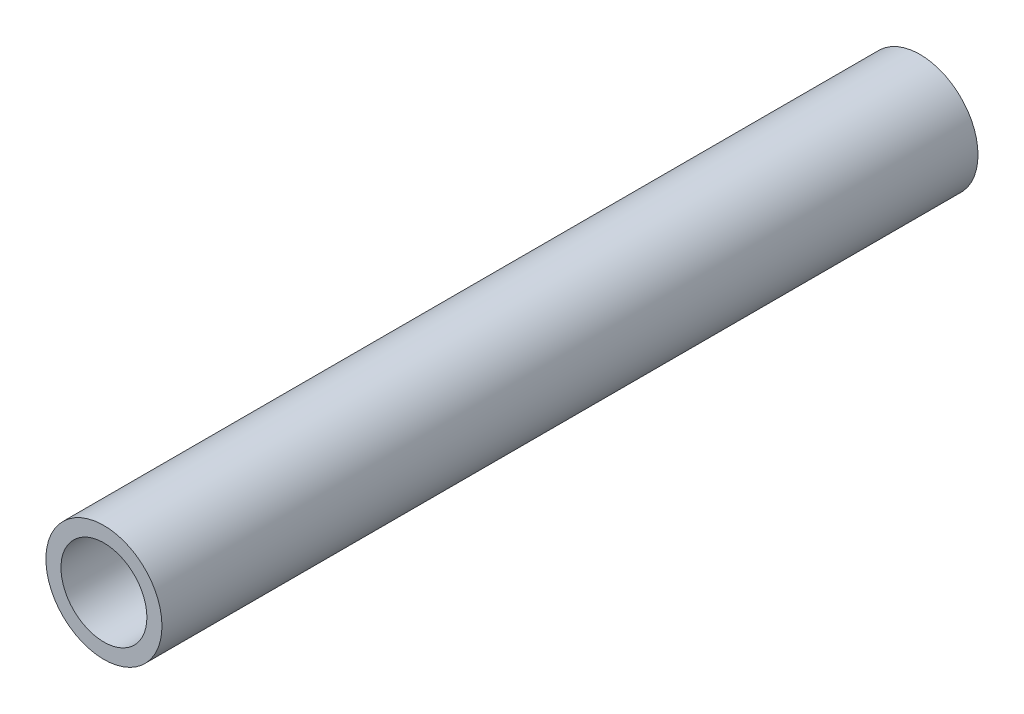
ISO-10303-21;
HEADER;
FILE_DESCRIPTION(('STEP AP214'),'2;1');
FILE_NAME('part.step','',(''),(''),'','','');
FILE_SCHEMA(('AUTOMOTIVE_DESIGN { 1 0 10303 214 1 1 1 1 }'));
ENDSEC;
DATA;
#1=APPLICATION_CONTEXT('core data for automotive mechanical design processes');
#2=APPLICATION_PROTOCOL_DEFINITION('international standard','automotive_design',2000,#1);
#3=PRODUCT_CONTEXT('',#1,'mechanical');
#4=PRODUCT('Part','Part','',(#3));
#5=PRODUCT_RELATED_PRODUCT_CATEGORY('part','',(#4));
#6=PRODUCT_DEFINITION_FORMATION('','',#4);
#7=PRODUCT_DEFINITION_CONTEXT('part definition',#1,'design');
#8=PRODUCT_DEFINITION('design','',#6,#7);
#9=PRODUCT_DEFINITION_SHAPE('','',#8);
#10=(LENGTH_UNIT() NAMED_UNIT(*) SI_UNIT(.MILLI.,.METRE.));
#11=(NAMED_UNIT(*) PLANE_ANGLE_UNIT() SI_UNIT($,.RADIAN.));
#12=(NAMED_UNIT(*) SI_UNIT($,.STERADIAN.) SOLID_ANGLE_UNIT());
#13=UNCERTAINTY_MEASURE_WITH_UNIT(LENGTH_MEASURE(1.E-05),#10,'distance_accuracy_value','');
#14=(GEOMETRIC_REPRESENTATION_CONTEXT(3) GLOBAL_UNCERTAINTY_ASSIGNED_CONTEXT((#13)) GLOBAL_UNIT_ASSIGNED_CONTEXT((#10,
#11,#12)) REPRESENTATION_CONTEXT('',''));
#15=CARTESIAN_POINT('',(0.,0.,0.));
#16=DIRECTION('',(0.,0.,1.));
#17=DIRECTION('',(1.,0.,0.));
#18=AXIS2_PLACEMENT_3D('',#15,#16,#17);
#19=CARTESIAN_POINT('',(0.,0.,75.));
#20=DIRECTION('',(0.,0.,1.));
#21=DIRECTION('',(1.,0.,0.));
#22=AXIS2_PLACEMENT_3D('',#19,#20,#21);
#23=PLANE('',#22);
#24=CARTESIAN_POINT('',(0.,0.,75.));
#25=DIRECTION('',(0.,0.,1.));
#26=DIRECTION('',(1.,0.,0.));
#27=AXIS2_PLACEMENT_3D('',#24,#25,#26);
#28=CIRCLE('',#27,10.668);
#29=CARTESIAN_POINT('',(10.668,0.,75.));
#30=VERTEX_POINT('',#29);
#31=EDGE_CURVE('E11',#30,#30,#28,.T.);
#32=ORIENTED_EDGE('',*,*,#31,.T.);
#33=EDGE_LOOP('',(#32));
#34=FACE_BOUND('',#33,.T.);
#35=CARTESIAN_POINT('',(0.,0.,75.));
#36=DIRECTION('',(0.,0.,1.));
#37=DIRECTION('',(1.,0.,0.));
#38=AXIS2_PLACEMENT_3D('',#35,#36,#37);
#39=CIRCLE('',#38,7.8994);
#40=CARTESIAN_POINT('',(7.8994,0.,75.));
#41=VERTEX_POINT('',#40);
#42=EDGE_CURVE('E48',#41,#41,#39,.T.);
#43=ORIENTED_EDGE('',*,*,#42,.F.);
#44=EDGE_LOOP('',(#43));
#45=FACE_BOUND('',#44,.T.);
#46=ADVANCED_FACE('F37',(#34,#45),#23,.T.);
#47=CARTESIAN_POINT('',(0.,0.,-75.));
#48=DIRECTION('',(0.,0.,1.));
#49=DIRECTION('',(1.,0.,0.));
#50=AXIS2_PLACEMENT_3D('',#47,#48,#49);
#51=PLANE('',#50);
#52=CARTESIAN_POINT('',(0.,0.,-75.));
#53=DIRECTION('',(0.,0.,1.));
#54=DIRECTION('',(1.,0.,0.));
#55=AXIS2_PLACEMENT_3D('',#52,#53,#54);
#56=CIRCLE('',#55,10.668);
#57=CARTESIAN_POINT('',(10.668,0.,-75.));
#58=VERTEX_POINT('',#57);
#59=EDGE_CURVE('E41',#58,#58,#56,.T.);
#60=ORIENTED_EDGE('',*,*,#59,.F.);
#61=EDGE_LOOP('',(#60));
#62=FACE_BOUND('',#61,.T.);
#63=CARTESIAN_POINT('',(0.,0.,-75.));
#64=DIRECTION('',(0.,0.,1.));
#65=DIRECTION('',(1.,0.,0.));
#66=AXIS2_PLACEMENT_3D('',#63,#64,#65);
#67=CIRCLE('',#66,7.8994);
#68=CARTESIAN_POINT('',(7.8994,0.,-75.));
#69=VERTEX_POINT('',#68);
#70=EDGE_CURVE('E50',#69,#69,#67,.T.);
#71=ORIENTED_EDGE('',*,*,#70,.T.);
#72=EDGE_LOOP('',(#71));
#73=FACE_BOUND('',#72,.T.);
#74=ADVANCED_FACE('F60',(#62,#73),#51,.F.);
#75=CARTESIAN_POINT('',(0.,0.,75.));
#76=DIRECTION('',(0.,0.,-1.));
#77=DIRECTION('',(-1.,0.,0.));
#78=AXIS2_PLACEMENT_3D('',#75,#76,#77);
#79=CYLINDRICAL_SURFACE('',#78,10.668);
#80=ORIENTED_EDGE('',*,*,#31,.F.);
#81=EDGE_LOOP('',(#80));
#82=FACE_BOUND('',#81,.T.);
#83=ORIENTED_EDGE('',*,*,#59,.T.);
#84=EDGE_LOOP('',(#83));
#85=FACE_BOUND('',#84,.T.);
#86=ADVANCED_FACE('F39',(#82,#85),#79,.T.);
#87=CARTESIAN_POINT('',(0.,0.,75.));
#88=DIRECTION('',(0.,0.,-1.));
#89=DIRECTION('',(-1.,0.,0.));
#90=AXIS2_PLACEMENT_3D('',#87,#88,#89);
#91=CYLINDRICAL_SURFACE('',#90,7.8994);
#92=ORIENTED_EDGE('',*,*,#42,.T.);
#93=EDGE_LOOP('',(#92));
#94=FACE_BOUND('',#93,.T.);
#95=ORIENTED_EDGE('',*,*,#70,.F.);
#96=EDGE_LOOP('',(#95));
#97=FACE_BOUND('',#96,.T.);
#98=ADVANCED_FACE('F56',(#94,#97),#91,.F.);
#99=CLOSED_SHELL('',(#46,#74,#86,#98));
#100=MANIFOLD_SOLID_BREP('B2',#99);
#101=ADVANCED_BREP_SHAPE_REPRESENTATION('',(#18,#100),#14);
#102=SHAPE_DEFINITION_REPRESENTATION(#9,#101);
ENDSEC;
END-ISO-10303-21;
